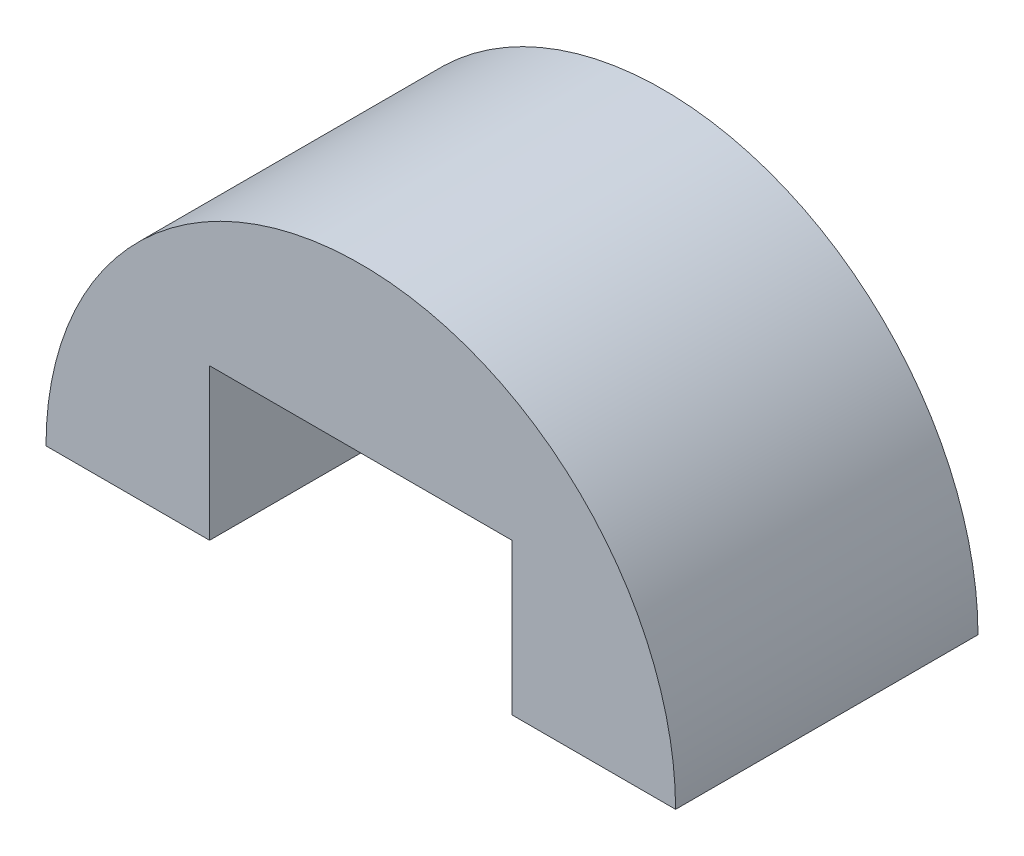
ISO-10303-21;
HEADER;
FILE_DESCRIPTION(('STEP AP214'),'2;1');
FILE_NAME('part.step','',(''),(''),'','','');
FILE_SCHEMA(('AUTOMOTIVE_DESIGN { 1 0 10303 214 1 1 1 1 }'));
ENDSEC;
DATA;
#1=APPLICATION_CONTEXT('core data for automotive mechanical design processes');
#2=APPLICATION_PROTOCOL_DEFINITION('international standard','automotive_design',2000,#1);
#3=PRODUCT_CONTEXT('',#1,'mechanical');
#4=PRODUCT('Part','Part','',(#3));
#5=PRODUCT_RELATED_PRODUCT_CATEGORY('part','',(#4));
#6=PRODUCT_DEFINITION_FORMATION('','',#4);
#7=PRODUCT_DEFINITION_CONTEXT('part definition',#1,'design');
#8=PRODUCT_DEFINITION('design','',#6,#7);
#9=PRODUCT_DEFINITION_SHAPE('','',#8);
#10=(LENGTH_UNIT() NAMED_UNIT(*) SI_UNIT(.MILLI.,.METRE.));
#11=(NAMED_UNIT(*) PLANE_ANGLE_UNIT() SI_UNIT($,.RADIAN.));
#12=(NAMED_UNIT(*) SI_UNIT($,.STERADIAN.) SOLID_ANGLE_UNIT());
#13=UNCERTAINTY_MEASURE_WITH_UNIT(LENGTH_MEASURE(1.E-05),#10,'distance_accuracy_value','');
#14=(GEOMETRIC_REPRESENTATION_CONTEXT(3) GLOBAL_UNCERTAINTY_ASSIGNED_CONTEXT((#13)) GLOBAL_UNIT_ASSIGNED_CONTEXT((#10,
#11,#12)) REPRESENTATION_CONTEXT('',''));
#15=CARTESIAN_POINT('',(0.,0.,0.));
#16=DIRECTION('',(0.,0.,1.));
#17=DIRECTION('',(1.,0.,0.));
#18=AXIS2_PLACEMENT_3D('',#15,#16,#17);
#19=CARTESIAN_POINT('',(3827.86521545947,1740.47224218998,6.));
#20=DIRECTION('',(-1.36826012490911E-13,1.,0.));
#21=DIRECTION('',(-1.,-1.36826012490911E-13,0.));
#22=AXIS2_PLACEMENT_3D('',#19,#20,#21);
#23=PLANE('',#22);
#24=DIRECTION('',(1.,1.36826012490911E-13,0.));
#25=VECTOR('',#24,1.);
#26=CARTESIAN_POINT('',(3827.86521545947,1740.47224218998,0.));
#27=LINE('',#26,#25);
#28=CARTESIAN_POINT('',(3827.86521545947,1740.47224218998,0.));
#29=VERTEX_POINT('',#28);
#30=CARTESIAN_POINT('',(3831.11086445388,1740.47224218998,0.));
#31=VERTEX_POINT('',#30);
#32=EDGE_CURVE('E128',#29,#31,#27,.T.);
#33=ORIENTED_EDGE('',*,*,#32,.T.);
#34=DIRECTION('',(0.,0.,-1.));
#35=VECTOR('',#34,1.);
#36=CARTESIAN_POINT('',(3831.11086445388,1740.47224218998,6.));
#37=LINE('',#36,#35);
#38=CARTESIAN_POINT('',(3831.11086445388,1740.47224218998,6.));
#39=VERTEX_POINT('',#38);
#40=EDGE_CURVE('E11',#39,#31,#37,.T.);
#41=ORIENTED_EDGE('',*,*,#40,.F.);
#42=DIRECTION('',(1.,1.36826012490911E-13,0.));
#43=VECTOR('',#42,1.);
#44=CARTESIAN_POINT('',(3827.86521545947,1740.47224218998,6.));
#45=LINE('',#44,#43);
#46=CARTESIAN_POINT('',(3827.86521545947,1740.47224218998,6.));
#47=VERTEX_POINT('',#46);
#48=EDGE_CURVE('E144',#47,#39,#45,.T.);
#49=ORIENTED_EDGE('',*,*,#48,.F.);
#50=DIRECTION('',(0.,0.,-1.));
#51=VECTOR('',#50,1.);
#52=CARTESIAN_POINT('',(3827.86521545947,1740.47224218998,6.));
#53=LINE('',#52,#51);
#54=EDGE_CURVE('E124',#47,#29,#53,.T.);
#55=ORIENTED_EDGE('',*,*,#54,.T.);
#56=EDGE_LOOP('',(#33,#41,#49,#55));
#57=FACE_BOUND('',#56,.T.);
#58=ADVANCED_FACE('F39',(#57),#23,.F.);
#59=CARTESIAN_POINT('',(3824.86521545947,1740.47224218998,6.));
#60=DIRECTION('',(0.,0.,-1.));
#61=DIRECTION('',(-1.,0.,0.));
#62=AXIS2_PLACEMENT_3D('',#59,#60,#61);
#63=CYLINDRICAL_SURFACE('',#62,6.24564899440871);
#64=CARTESIAN_POINT('',(3824.86521545947,1740.47224218998,0.));
#65=DIRECTION('',(0.,0.,1.));
#66=DIRECTION('',(1.,0.,0.));
#67=AXIS2_PLACEMENT_3D('',#64,#65,#66);
#68=CIRCLE('',#67,6.24564899440871);
#69=CARTESIAN_POINT('',(3818.61956646506,1740.47224218998,0.));
#70=VERTEX_POINT('',#69);
#71=EDGE_CURVE('E132',#31,#70,#68,.T.);
#72=ORIENTED_EDGE('',*,*,#71,.T.);
#73=DIRECTION('',(0.,0.,-1.));
#74=VECTOR('',#73,1.);
#75=CARTESIAN_POINT('',(3818.61956646506,1740.47224218998,6.));
#76=LINE('',#75,#74);
#77=CARTESIAN_POINT('',(3818.61956646506,1740.47224218998,6.));
#78=VERTEX_POINT('',#77);
#79=EDGE_CURVE('E48',#78,#70,#76,.T.);
#80=ORIENTED_EDGE('',*,*,#79,.F.);
#81=CARTESIAN_POINT('',(3824.86521545947,1740.47224218998,6.));
#82=DIRECTION('',(0.,0.,1.));
#83=DIRECTION('',(1.,0.,0.));
#84=AXIS2_PLACEMENT_3D('',#81,#82,#83);
#85=CIRCLE('',#84,6.24564899440871);
#86=EDGE_CURVE('E93',#39,#78,#85,.T.);
#87=ORIENTED_EDGE('',*,*,#86,.F.);
#88=ORIENTED_EDGE('',*,*,#40,.T.);
#89=EDGE_LOOP('',(#72,#80,#87,#88));
#90=FACE_BOUND('',#89,.T.);
#91=ADVANCED_FACE('F172',(#90),#63,.T.);
#92=CARTESIAN_POINT('',(3818.61956646506,1740.47224218998,6.));
#93=DIRECTION('',(-2.73652024981821E-13,1.,0.));
#94=DIRECTION('',(-1.,-2.73652024981821E-13,0.));
#95=AXIS2_PLACEMENT_3D('',#92,#93,#94);
#96=PLANE('',#95);
#97=DIRECTION('',(1.,2.73652024981821E-13,0.));
#98=VECTOR('',#97,1.);
#99=CARTESIAN_POINT('',(3818.61956646506,1740.47224218998,0.));
#100=LINE('',#99,#98);
#101=CARTESIAN_POINT('',(3821.86521545947,1740.47224218998,0.));
#102=VERTEX_POINT('',#101);
#103=EDGE_CURVE('E135',#70,#102,#100,.T.);
#104=ORIENTED_EDGE('',*,*,#103,.T.);
#105=DIRECTION('',(0.,0.,-1.));
#106=VECTOR('',#105,1.);
#107=CARTESIAN_POINT('',(3821.86521545947,1740.47224218998,6.));
#108=LINE('',#107,#106);
#109=CARTESIAN_POINT('',(3821.86521545947,1740.47224218998,6.));
#110=VERTEX_POINT('',#109);
#111=EDGE_CURVE('E117',#110,#102,#108,.T.);
#112=ORIENTED_EDGE('',*,*,#111,.F.);
#113=DIRECTION('',(1.,2.73652024981821E-13,0.));
#114=VECTOR('',#113,1.);
#115=CARTESIAN_POINT('',(3818.61956646506,1740.47224218998,6.));
#116=LINE('',#115,#114);
#117=EDGE_CURVE('E106',#78,#110,#116,.T.);
#118=ORIENTED_EDGE('',*,*,#117,.F.);
#119=ORIENTED_EDGE('',*,*,#79,.T.);
#120=EDGE_LOOP('',(#104,#112,#118,#119));
#121=FACE_BOUND('',#120,.T.);
#122=ADVANCED_FACE('F154',(#121),#96,.F.);
#123=CARTESIAN_POINT('',(3821.86521545947,1740.47224218998,6.));
#124=DIRECTION('',(-1.,0.,0.));
#125=DIRECTION('',(0.,0.,1.));
#126=AXIS2_PLACEMENT_3D('',#123,#124,#125);
#127=PLANE('',#126);
#128=DIRECTION('',(0.,1.,0.));
#129=VECTOR('',#128,1.);
#130=CARTESIAN_POINT('',(3821.86521545947,1740.47224218998,0.));
#131=LINE('',#130,#129);
#132=CARTESIAN_POINT('',(3821.86521545947,1743.47224218998,0.));
#133=VERTEX_POINT('',#132);
#134=EDGE_CURVE('E115',#102,#133,#131,.T.);
#135=ORIENTED_EDGE('',*,*,#134,.T.);
#136=DIRECTION('',(0.,0.,-1.));
#137=VECTOR('',#136,1.);
#138=CARTESIAN_POINT('',(3821.86521545947,1743.47224218998,6.));
#139=LINE('',#138,#137);
#140=CARTESIAN_POINT('',(3821.86521545947,1743.47224218998,6.));
#141=VERTEX_POINT('',#140);
#142=EDGE_CURVE('E112',#141,#133,#139,.T.);
#143=ORIENTED_EDGE('',*,*,#142,.F.);
#144=DIRECTION('',(0.,1.,0.));
#145=VECTOR('',#144,1.);
#146=CARTESIAN_POINT('',(3821.86521545947,1740.47224218998,6.));
#147=LINE('',#146,#145);
#148=EDGE_CURVE('E100',#110,#141,#147,.T.);
#149=ORIENTED_EDGE('',*,*,#148,.F.);
#150=ORIENTED_EDGE('',*,*,#111,.T.);
#151=EDGE_LOOP('',(#135,#143,#149,#150));
#152=FACE_BOUND('',#151,.T.);
#153=ADVANCED_FACE('F113',(#152),#127,.F.);
#154=CARTESIAN_POINT('',(3821.86521545947,1743.47224218998,6.));
#155=DIRECTION('',(0.,1.,0.));
#156=DIRECTION('',(0.,0.,1.));
#157=AXIS2_PLACEMENT_3D('',#154,#155,#156);
#158=PLANE('',#157);
#159=DIRECTION('',(1.,0.,0.));
#160=VECTOR('',#159,1.);
#161=CARTESIAN_POINT('',(3821.86521545947,1743.47224218998,0.));
#162=LINE('',#161,#160);
#163=CARTESIAN_POINT('',(3827.86521545947,1743.47224218998,0.));
#164=VERTEX_POINT('',#163);
#165=EDGE_CURVE('E79',#133,#164,#162,.T.);
#166=ORIENTED_EDGE('',*,*,#165,.T.);
#167=DIRECTION('',(0.,0.,-1.));
#168=VECTOR('',#167,1.);
#169=CARTESIAN_POINT('',(3827.86521545947,1743.47224218998,6.));
#170=LINE('',#169,#168);
#171=CARTESIAN_POINT('',(3827.86521545947,1743.47224218998,6.));
#172=VERTEX_POINT('',#171);
#173=EDGE_CURVE('E118',#172,#164,#170,.T.);
#174=ORIENTED_EDGE('',*,*,#173,.F.);
#175=DIRECTION('',(1.,0.,0.));
#176=VECTOR('',#175,1.);
#177=CARTESIAN_POINT('',(3821.86521545947,1743.47224218998,6.));
#178=LINE('',#177,#176);
#179=EDGE_CURVE('E104',#141,#172,#178,.T.);
#180=ORIENTED_EDGE('',*,*,#179,.F.);
#181=ORIENTED_EDGE('',*,*,#142,.T.);
#182=EDGE_LOOP('',(#166,#174,#180,#181));
#183=FACE_BOUND('',#182,.T.);
#184=ADVANCED_FACE('F120',(#183),#158,.F.);
#185=CARTESIAN_POINT('',(3827.86521545947,1743.47224218998,6.));
#186=DIRECTION('',(1.,0.,0.));
#187=DIRECTION('',(0.,0.,-1.));
#188=AXIS2_PLACEMENT_3D('',#185,#186,#187);
#189=PLANE('',#188);
#190=DIRECTION('',(0.,-1.,0.));
#191=VECTOR('',#190,1.);
#192=CARTESIAN_POINT('',(3827.86521545947,1743.47224218998,0.));
#193=LINE('',#192,#191);
#194=EDGE_CURVE('E85',#164,#29,#193,.T.);
#195=ORIENTED_EDGE('',*,*,#194,.T.);
#196=ORIENTED_EDGE('',*,*,#54,.F.);
#197=DIRECTION('',(0.,-1.,0.));
#198=VECTOR('',#197,1.);
#199=CARTESIAN_POINT('',(3827.86521545947,1743.47224218998,6.));
#200=LINE('',#199,#198);
#201=EDGE_CURVE('E56',#172,#47,#200,.T.);
#202=ORIENTED_EDGE('',*,*,#201,.F.);
#203=ORIENTED_EDGE('',*,*,#173,.T.);
#204=EDGE_LOOP('',(#195,#196,#202,#203));
#205=FACE_BOUND('',#204,.T.);
#206=ADVANCED_FACE('F161',(#205),#189,.F.);
#207=CARTESIAN_POINT('',(3824.86521545947,1740.47224218998,6.));
#208=DIRECTION('',(0.,0.,1.));
#209=DIRECTION('',(1.,0.,0.));
#210=AXIS2_PLACEMENT_3D('',#207,#208,#209);
#211=PLANE('',#210);
#212=ORIENTED_EDGE('',*,*,#48,.T.);
#213=ORIENTED_EDGE('',*,*,#86,.T.);
#214=ORIENTED_EDGE('',*,*,#117,.T.);
#215=ORIENTED_EDGE('',*,*,#148,.T.);
#216=ORIENTED_EDGE('',*,*,#179,.T.);
#217=ORIENTED_EDGE('',*,*,#201,.T.);
#218=EDGE_LOOP('',(#212,#213,#214,#215,#216,#217));
#219=FACE_BOUND('',#218,.T.);
#220=ADVANCED_FACE('F102',(#219),#211,.T.);
#221=CARTESIAN_POINT('',(3824.86521545947,1740.47224218998,0.));
#222=DIRECTION('',(0.,0.,1.));
#223=DIRECTION('',(1.,0.,0.));
#224=AXIS2_PLACEMENT_3D('',#221,#222,#223);
#225=PLANE('',#224);
#226=ORIENTED_EDGE('',*,*,#32,.F.);
#227=ORIENTED_EDGE('',*,*,#194,.F.);
#228=ORIENTED_EDGE('',*,*,#165,.F.);
#229=ORIENTED_EDGE('',*,*,#134,.F.);
#230=ORIENTED_EDGE('',*,*,#103,.F.);
#231=ORIENTED_EDGE('',*,*,#71,.F.);
#232=EDGE_LOOP('',(#226,#227,#228,#229,#230,#231));
#233=FACE_BOUND('',#232,.T.);
#234=ADVANCED_FACE('F157',(#233),#225,.F.);
#235=CLOSED_SHELL('',(#58,#91,#122,#153,#184,#206,#220,#234));
#236=MANIFOLD_SOLID_BREP('B2',#235);
#237=ADVANCED_BREP_SHAPE_REPRESENTATION('',(#18,#236),#14);
#238=SHAPE_DEFINITION_REPRESENTATION(#9,#237);
ENDSEC;
END-ISO-10303-21;
